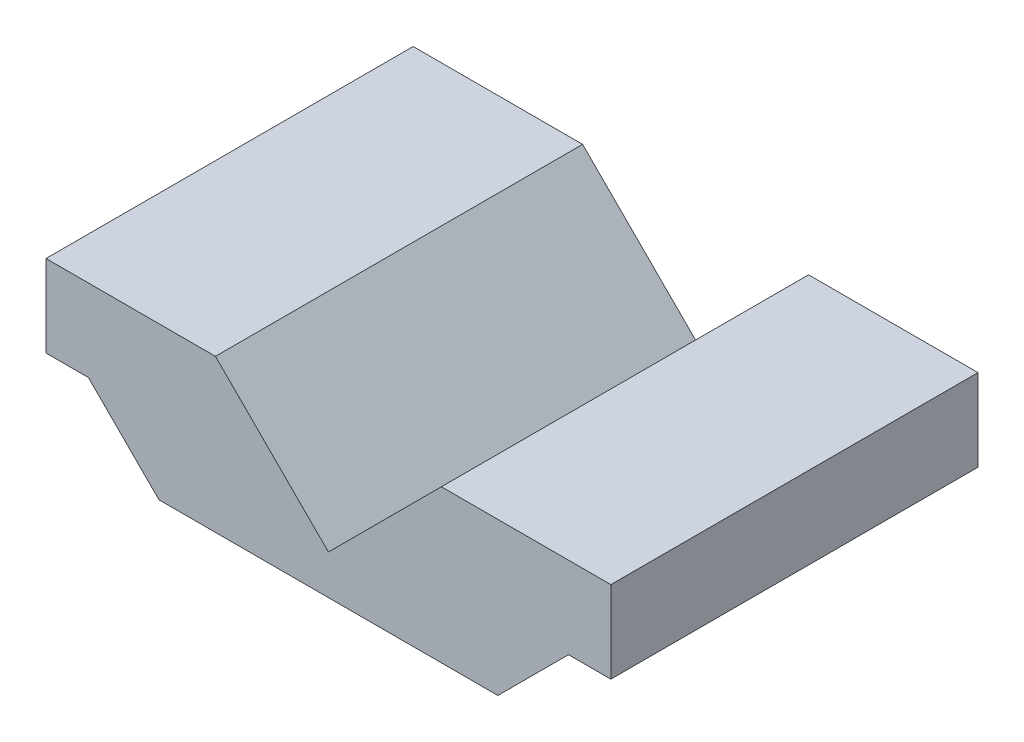
ISO-10303-21;
HEADER;
FILE_DESCRIPTION(('STEP AP214'),'2;1');
FILE_NAME('part.step','',(''),(''),'','','');
FILE_SCHEMA(('AUTOMOTIVE_DESIGN { 1 0 10303 214 1 1 1 1 }'));
ENDSEC;
DATA;
#1=APPLICATION_CONTEXT('core data for automotive mechanical design processes');
#2=APPLICATION_PROTOCOL_DEFINITION('international standard','automotive_design',2000,#1);
#3=PRODUCT_CONTEXT('',#1,'mechanical');
#4=PRODUCT('Part','Part','',(#3));
#5=PRODUCT_RELATED_PRODUCT_CATEGORY('part','',(#4));
#6=PRODUCT_DEFINITION_FORMATION('','',#4);
#7=PRODUCT_DEFINITION_CONTEXT('part definition',#1,'design');
#8=PRODUCT_DEFINITION('design','',#6,#7);
#9=PRODUCT_DEFINITION_SHAPE('','',#8);
#10=(LENGTH_UNIT() NAMED_UNIT(*) SI_UNIT(.MILLI.,.METRE.));
#11=(NAMED_UNIT(*) PLANE_ANGLE_UNIT() SI_UNIT($,.RADIAN.));
#12=(NAMED_UNIT(*) SI_UNIT($,.STERADIAN.) SOLID_ANGLE_UNIT());
#13=UNCERTAINTY_MEASURE_WITH_UNIT(LENGTH_MEASURE(1.E-05),#10,'distance_accuracy_value','');
#14=(GEOMETRIC_REPRESENTATION_CONTEXT(3) GLOBAL_UNCERTAINTY_ASSIGNED_CONTEXT((#13)) GLOBAL_UNIT_ASSIGNED_CONTEXT((#10,
#11,#12)) REPRESENTATION_CONTEXT('',''));
#15=CARTESIAN_POINT('',(0.,0.,0.));
#16=DIRECTION('',(0.,0.,1.));
#17=DIRECTION('',(1.,0.,0.));
#18=AXIS2_PLACEMENT_3D('',#15,#16,#17);
#19=CARTESIAN_POINT('',(30.,0.,32.5));
#20=DIRECTION('',(-0.707106781186549,0.707106781186546,0.));
#21=DIRECTION('',(-0.707106781186546,-0.707106781186549,0.));
#22=AXIS2_PLACEMENT_3D('',#19,#20,#21);
#23=PLANE('',#22);
#24=DIRECTION('',(0.707106781186546,0.707106781186549,0.));
#25=VECTOR('',#24,1.);
#26=CARTESIAN_POINT('',(30.,0.,-32.5));
#27=LINE('',#26,#25);
#28=CARTESIAN_POINT('',(30.,0.,-32.5));
#29=VERTEX_POINT('',#28);
#30=CARTESIAN_POINT('',(42.5,12.5,-32.5));
#31=VERTEX_POINT('',#30);
#32=EDGE_CURVE('E147',#29,#31,#27,.T.);
#33=ORIENTED_EDGE('',*,*,#32,.T.);
#34=DIRECTION('',(0.,0.,-1.));
#35=VECTOR('',#34,1.);
#36=CARTESIAN_POINT('',(42.5,12.5,32.5));
#37=LINE('',#36,#35);
#38=CARTESIAN_POINT('',(42.5,12.5,32.5));
#39=VERTEX_POINT('',#38);
#40=EDGE_CURVE('E11',#39,#31,#37,.T.);
#41=ORIENTED_EDGE('',*,*,#40,.F.);
#42=DIRECTION('',(0.707106781186546,0.707106781186549,0.));
#43=VECTOR('',#42,1.);
#44=CARTESIAN_POINT('',(30.,0.,32.5));
#45=LINE('',#44,#43);
#46=CARTESIAN_POINT('',(30.,0.,32.5));
#47=VERTEX_POINT('',#46);
#48=EDGE_CURVE('E167',#47,#39,#45,.T.);
#49=ORIENTED_EDGE('',*,*,#48,.F.);
#50=DIRECTION('',(0.,0.,-1.));
#51=VECTOR('',#50,1.);
#52=CARTESIAN_POINT('',(30.,0.,32.5));
#53=LINE('',#52,#51);
#54=EDGE_CURVE('E143',#47,#29,#53,.T.);
#55=ORIENTED_EDGE('',*,*,#54,.T.);
#56=EDGE_LOOP('',(#33,#41,#49,#55));
#57=FACE_BOUND('',#56,.T.);
#58=ADVANCED_FACE('F33',(#57),#23,.F.);
#59=CARTESIAN_POINT('',(42.5,12.5,32.5));
#60=DIRECTION('',(0.,1.,0.));
#61=DIRECTION('',(0.,0.,1.));
#62=AXIS2_PLACEMENT_3D('',#59,#60,#61);
#63=PLANE('',#62);
#64=DIRECTION('',(1.,0.,0.));
#65=VECTOR('',#64,1.);
#66=CARTESIAN_POINT('',(42.5,12.5,-32.5));
#67=LINE('',#66,#65);
#68=CARTESIAN_POINT('',(50.,12.5,-32.5));
#69=VERTEX_POINT('',#68);
#70=EDGE_CURVE('E150',#31,#69,#67,.T.);
#71=ORIENTED_EDGE('',*,*,#70,.T.);
#72=DIRECTION('',(0.,0.,-1.));
#73=VECTOR('',#72,1.);
#74=CARTESIAN_POINT('',(50.,12.5,32.5));
#75=LINE('',#74,#73);
#76=CARTESIAN_POINT('',(50.,12.5,32.5));
#77=VERTEX_POINT('',#76);
#78=EDGE_CURVE('E41',#77,#69,#75,.T.);
#79=ORIENTED_EDGE('',*,*,#78,.F.);
#80=DIRECTION('',(1.,0.,0.));
#81=VECTOR('',#80,1.);
#82=CARTESIAN_POINT('',(42.5,12.5,32.5));
#83=LINE('',#82,#81);
#84=EDGE_CURVE('E101',#39,#77,#83,.T.);
#85=ORIENTED_EDGE('',*,*,#84,.F.);
#86=ORIENTED_EDGE('',*,*,#40,.T.);
#87=EDGE_LOOP('',(#71,#79,#85,#86));
#88=FACE_BOUND('',#87,.T.);
#89=ADVANCED_FACE('F239',(#88),#63,.F.);
#90=CARTESIAN_POINT('',(50.,12.5,32.5));
#91=DIRECTION('',(-1.,0.,0.));
#92=DIRECTION('',(0.,-1.,0.));
#93=AXIS2_PLACEMENT_3D('',#90,#91,#92);
#94=PLANE('',#93);
#95=DIRECTION('',(0.,1.,0.));
#96=VECTOR('',#95,1.);
#97=CARTESIAN_POINT('',(50.,12.5,-32.5));
#98=LINE('',#97,#96);
#99=CARTESIAN_POINT('',(50.,27.,-32.5));
#100=VERTEX_POINT('',#99);
#101=EDGE_CURVE('E152',#69,#100,#98,.T.);
#102=ORIENTED_EDGE('',*,*,#101,.T.);
#103=DIRECTION('',(0.,0.,-1.));
#104=VECTOR('',#103,1.);
#105=CARTESIAN_POINT('',(50.,27.,32.5));
#106=LINE('',#105,#104);
#107=CARTESIAN_POINT('',(50.,27.,32.5));
#108=VERTEX_POINT('',#107);
#109=EDGE_CURVE('E183',#108,#100,#106,.T.);
#110=ORIENTED_EDGE('',*,*,#109,.F.);
#111=DIRECTION('',(0.,1.,0.));
#112=VECTOR('',#111,1.);
#113=CARTESIAN_POINT('',(50.,12.5,32.5));
#114=LINE('',#113,#112);
#115=EDGE_CURVE('E191',#77,#108,#114,.T.);
#116=ORIENTED_EDGE('',*,*,#115,.F.);
#117=ORIENTED_EDGE('',*,*,#78,.T.);
#118=EDGE_LOOP('',(#102,#110,#116,#117));
#119=FACE_BOUND('',#118,.T.);
#120=ADVANCED_FACE('F189',(#119),#94,.F.);
#121=CARTESIAN_POINT('',(50.,27.,32.5));
#122=DIRECTION('',(0.,-1.,0.));
#123=DIRECTION('',(1.,0.,0.));
#124=AXIS2_PLACEMENT_3D('',#121,#122,#123);
#125=PLANE('',#124);
#126=DIRECTION('',(-1.,0.,0.));
#127=VECTOR('',#126,1.);
#128=CARTESIAN_POINT('',(50.,27.,-32.5));
#129=LINE('',#128,#127);
#130=CARTESIAN_POINT('',(20.,27.,-32.5));
#131=VERTEX_POINT('',#130);
#132=EDGE_CURVE('E154',#100,#131,#129,.T.);
#133=ORIENTED_EDGE('',*,*,#132,.T.);
#134=DIRECTION('',(0.,0.,-1.));
#135=VECTOR('',#134,1.);
#136=CARTESIAN_POINT('',(20.,27.,32.5));
#137=LINE('',#136,#135);
#138=CARTESIAN_POINT('',(20.,27.,32.5));
#139=VERTEX_POINT('',#138);
#140=EDGE_CURVE('E180',#139,#131,#137,.T.);
#141=ORIENTED_EDGE('',*,*,#140,.F.);
#142=DIRECTION('',(-1.,0.,0.));
#143=VECTOR('',#142,1.);
#144=CARTESIAN_POINT('',(50.,27.,32.5));
#145=LINE('',#144,#143);
#146=EDGE_CURVE('E209',#108,#139,#145,.T.);
#147=ORIENTED_EDGE('',*,*,#146,.F.);
#148=ORIENTED_EDGE('',*,*,#109,.T.);
#149=EDGE_LOOP('',(#133,#141,#147,#148));
#150=FACE_BOUND('',#149,.T.);
#151=ADVANCED_FACE('F200',(#150),#125,.F.);
#152=CARTESIAN_POINT('',(20.,27.,32.5));
#153=DIRECTION('',(0.707106781186551,-0.707106781186543,0.));
#154=DIRECTION('',(0.707106781186544,0.707106781186551,0.));
#155=AXIS2_PLACEMENT_3D('',#152,#153,#154);
#156=PLANE('',#155);
#157=DIRECTION('',(-0.707106781186544,-0.707106781186551,0.));
#158=VECTOR('',#157,1.);
#159=CARTESIAN_POINT('',(20.,27.,-32.5));
#160=LINE('',#159,#158);
#161=CARTESIAN_POINT('',(0.,6.99999999999977,-32.5));
#162=VERTEX_POINT('',#161);
#163=EDGE_CURVE('E156',#131,#162,#160,.T.);
#164=ORIENTED_EDGE('',*,*,#163,.T.);
#165=DIRECTION('',(0.,0.,-1.));
#166=VECTOR('',#165,1.);
#167=CARTESIAN_POINT('',(0.,6.99999999999977,32.5));
#168=LINE('',#167,#166);
#169=CARTESIAN_POINT('',(0.,6.99999999999977,32.5));
#170=VERTEX_POINT('',#169);
#171=EDGE_CURVE('E177',#170,#162,#168,.T.);
#172=ORIENTED_EDGE('',*,*,#171,.F.);
#173=DIRECTION('',(-0.707106781186544,-0.707106781186551,0.));
#174=VECTOR('',#173,1.);
#175=CARTESIAN_POINT('',(20.,27.,32.5));
#176=LINE('',#175,#174);
#177=EDGE_CURVE('E206',#139,#170,#176,.T.);
#178=ORIENTED_EDGE('',*,*,#177,.F.);
#179=ORIENTED_EDGE('',*,*,#140,.T.);
#180=EDGE_LOOP('',(#164,#172,#178,#179));
#181=FACE_BOUND('',#180,.T.);
#182=ADVANCED_FACE('F204',(#181),#156,.F.);
#183=CARTESIAN_POINT('',(-20.,27.,32.5));
#184=DIRECTION('',(-0.707106781186551,-0.707106781186543,0.));
#185=DIRECTION('',(0.707106781186544,-0.707106781186551,0.));
#186=AXIS2_PLACEMENT_3D('',#183,#184,#185);
#187=PLANE('',#186);
#188=DIRECTION('',(-0.707106781186544,0.707106781186551,0.));
#189=VECTOR('',#188,1.);
#190=CARTESIAN_POINT('',(-20.,27.,-32.5));
#191=LINE('',#190,#189);
#192=CARTESIAN_POINT('',(-20.,27.,-32.5));
#193=VERTEX_POINT('',#192);
#194=EDGE_CURVE('E158',#162,#193,#191,.T.);
#195=ORIENTED_EDGE('',*,*,#194,.T.);
#196=DIRECTION('',(0.,0.,-1.));
#197=VECTOR('',#196,1.);
#198=CARTESIAN_POINT('',(-20.,27.,32.5));
#199=LINE('',#198,#197);
#200=CARTESIAN_POINT('',(-20.,27.,32.5));
#201=VERTEX_POINT('',#200);
#202=EDGE_CURVE('E174',#201,#193,#199,.T.);
#203=ORIENTED_EDGE('',*,*,#202,.F.);
#204=DIRECTION('',(-0.707106781186544,0.707106781186551,0.));
#205=VECTOR('',#204,1.);
#206=CARTESIAN_POINT('',(-20.,27.,32.5));
#207=LINE('',#206,#205);
#208=EDGE_CURVE('E208',#170,#201,#207,.T.);
#209=ORIENTED_EDGE('',*,*,#208,.F.);
#210=ORIENTED_EDGE('',*,*,#171,.T.);
#211=EDGE_LOOP('',(#195,#203,#209,#210));
#212=FACE_BOUND('',#211,.T.);
#213=ADVANCED_FACE('F252',(#212),#187,.F.);
#214=CARTESIAN_POINT('',(-50.,27.,32.5));
#215=DIRECTION('',(0.,-1.,0.));
#216=DIRECTION('',(1.,0.,0.));
#217=AXIS2_PLACEMENT_3D('',#214,#215,#216);
#218=PLANE('',#217);
#219=DIRECTION('',(-1.,0.,0.));
#220=VECTOR('',#219,1.);
#221=CARTESIAN_POINT('',(-50.,27.,-32.5));
#222=LINE('',#221,#220);
#223=CARTESIAN_POINT('',(-50.,27.,-32.5));
#224=VERTEX_POINT('',#223);
#225=EDGE_CURVE('E160',#193,#224,#222,.T.);
#226=ORIENTED_EDGE('',*,*,#225,.T.);
#227=DIRECTION('',(0.,0.,-1.));
#228=VECTOR('',#227,1.);
#229=CARTESIAN_POINT('',(-50.,27.,32.5));
#230=LINE('',#229,#228);
#231=CARTESIAN_POINT('',(-50.,27.,32.5));
#232=VERTEX_POINT('',#231);
#233=EDGE_CURVE('E171',#232,#224,#230,.T.);
#234=ORIENTED_EDGE('',*,*,#233,.F.);
#235=DIRECTION('',(-1.,0.,0.));
#236=VECTOR('',#235,1.);
#237=CARTESIAN_POINT('',(-50.,27.,32.5));
#238=LINE('',#237,#236);
#239=EDGE_CURVE('E211',#201,#232,#238,.T.);
#240=ORIENTED_EDGE('',*,*,#239,.F.);
#241=ORIENTED_EDGE('',*,*,#202,.T.);
#242=EDGE_LOOP('',(#226,#234,#240,#241));
#243=FACE_BOUND('',#242,.T.);
#244=ADVANCED_FACE('F220',(#243),#218,.F.);
#245=CARTESIAN_POINT('',(-50.,12.5,32.5));
#246=DIRECTION('',(1.,0.,0.));
#247=DIRECTION('',(0.,1.,0.));
#248=AXIS2_PLACEMENT_3D('',#245,#246,#247);
#249=PLANE('',#248);
#250=DIRECTION('',(0.,-1.,0.));
#251=VECTOR('',#250,1.);
#252=CARTESIAN_POINT('',(-50.,12.5,-32.5));
#253=LINE('',#252,#251);
#254=CARTESIAN_POINT('',(-50.,12.5,-32.5));
#255=VERTEX_POINT('',#254);
#256=EDGE_CURVE('E162',#224,#255,#253,.T.);
#257=ORIENTED_EDGE('',*,*,#256,.T.);
#258=DIRECTION('',(0.,0.,-1.));
#259=VECTOR('',#258,1.);
#260=CARTESIAN_POINT('',(-50.,12.5,32.5));
#261=LINE('',#260,#259);
#262=CARTESIAN_POINT('',(-50.,12.5,32.5));
#263=VERTEX_POINT('',#262);
#264=EDGE_CURVE('E138',#263,#255,#261,.T.);
#265=ORIENTED_EDGE('',*,*,#264,.F.);
#266=DIRECTION('',(0.,-1.,0.));
#267=VECTOR('',#266,1.);
#268=CARTESIAN_POINT('',(-50.,12.5,32.5));
#269=LINE('',#268,#267);
#270=EDGE_CURVE('E129',#232,#263,#269,.T.);
#271=ORIENTED_EDGE('',*,*,#270,.F.);
#272=ORIENTED_EDGE('',*,*,#233,.T.);
#273=EDGE_LOOP('',(#257,#265,#271,#272));
#274=FACE_BOUND('',#273,.T.);
#275=ADVANCED_FACE('F224',(#274),#249,.F.);
#276=CARTESIAN_POINT('',(-42.5,12.5,32.5));
#277=DIRECTION('',(0.,1.,0.));
#278=DIRECTION('',(0.,0.,1.));
#279=AXIS2_PLACEMENT_3D('',#276,#277,#278);
#280=PLANE('',#279);
#281=DIRECTION('',(1.,0.,0.));
#282=VECTOR('',#281,1.);
#283=CARTESIAN_POINT('',(-42.5,12.5,-32.5));
#284=LINE('',#283,#282);
#285=CARTESIAN_POINT('',(-42.5,12.5,-32.5));
#286=VERTEX_POINT('',#285);
#287=EDGE_CURVE('E137',#255,#286,#284,.T.);
#288=ORIENTED_EDGE('',*,*,#287,.T.);
#289=DIRECTION('',(0.,0.,-1.));
#290=VECTOR('',#289,1.);
#291=CARTESIAN_POINT('',(-42.5,12.5,32.5));
#292=LINE('',#291,#290);
#293=CARTESIAN_POINT('',(-42.5,12.5,32.5));
#294=VERTEX_POINT('',#293);
#295=EDGE_CURVE('E134',#294,#286,#292,.T.);
#296=ORIENTED_EDGE('',*,*,#295,.F.);
#297=DIRECTION('',(1.,0.,0.));
#298=VECTOR('',#297,1.);
#299=CARTESIAN_POINT('',(-42.5,12.5,32.5));
#300=LINE('',#299,#298);
#301=EDGE_CURVE('E123',#263,#294,#300,.T.);
#302=ORIENTED_EDGE('',*,*,#301,.F.);
#303=ORIENTED_EDGE('',*,*,#264,.T.);
#304=EDGE_LOOP('',(#288,#296,#302,#303));
#305=FACE_BOUND('',#304,.T.);
#306=ADVANCED_FACE('F135',(#305),#280,.F.);
#307=CARTESIAN_POINT('',(-30.,0.,32.5));
#308=DIRECTION('',(0.707106781186549,0.707106781186546,0.));
#309=DIRECTION('',(-0.707106781186546,0.707106781186549,0.));
#310=AXIS2_PLACEMENT_3D('',#307,#308,#309);
#311=PLANE('',#310);
#312=DIRECTION('',(0.707106781186546,-0.707106781186549,0.));
#313=VECTOR('',#312,1.);
#314=CARTESIAN_POINT('',(-30.,0.,-32.5));
#315=LINE('',#314,#313);
#316=CARTESIAN_POINT('',(-30.,0.,-32.5));
#317=VERTEX_POINT('',#316);
#318=EDGE_CURVE('E87',#286,#317,#315,.T.);
#319=ORIENTED_EDGE('',*,*,#318,.T.);
#320=DIRECTION('',(0.,0.,-1.));
#321=VECTOR('',#320,1.);
#322=CARTESIAN_POINT('',(-30.,0.,32.5));
#323=LINE('',#322,#321);
#324=CARTESIAN_POINT('',(-30.,0.,32.5));
#325=VERTEX_POINT('',#324);
#326=EDGE_CURVE('E139',#325,#317,#323,.T.);
#327=ORIENTED_EDGE('',*,*,#326,.F.);
#328=DIRECTION('',(0.707106781186546,-0.707106781186549,0.));
#329=VECTOR('',#328,1.);
#330=CARTESIAN_POINT('',(-30.,0.,32.5));
#331=LINE('',#330,#329);
#332=EDGE_CURVE('E127',#294,#325,#331,.T.);
#333=ORIENTED_EDGE('',*,*,#332,.F.);
#334=ORIENTED_EDGE('',*,*,#295,.T.);
#335=EDGE_LOOP('',(#319,#327,#333,#334));
#336=FACE_BOUND('',#335,.T.);
#337=ADVANCED_FACE('F141',(#336),#311,.F.);
#338=CARTESIAN_POINT('',(-30.,0.,32.5));
#339=DIRECTION('',(0.,1.,0.));
#340=DIRECTION('',(0.,0.,1.));
#341=AXIS2_PLACEMENT_3D('',#338,#339,#340);
#342=PLANE('',#341);
#343=DIRECTION('',(1.,0.,0.));
#344=VECTOR('',#343,1.);
#345=CARTESIAN_POINT('',(-30.,0.,-32.5));
#346=LINE('',#345,#344);
#347=EDGE_CURVE('E93',#317,#29,#346,.T.);
#348=ORIENTED_EDGE('',*,*,#347,.T.);
#349=ORIENTED_EDGE('',*,*,#54,.F.);
#350=DIRECTION('',(1.,0.,0.));
#351=VECTOR('',#350,1.);
#352=CARTESIAN_POINT('',(-30.,0.,32.5));
#353=LINE('',#352,#351);
#354=EDGE_CURVE('E49',#325,#47,#353,.T.);
#355=ORIENTED_EDGE('',*,*,#354,.F.);
#356=ORIENTED_EDGE('',*,*,#326,.T.);
#357=EDGE_LOOP('',(#348,#349,#355,#356));
#358=FACE_BOUND('',#357,.T.);
#359=ADVANCED_FACE('F228',(#358),#342,.F.);
#360=CARTESIAN_POINT('',(0.,0.,32.5));
#361=DIRECTION('',(0.,0.,-1.));
#362=DIRECTION('',(-1.,0.,0.));
#363=AXIS2_PLACEMENT_3D('',#360,#361,#362);
#364=PLANE('',#363);
#365=ORIENTED_EDGE('',*,*,#48,.T.);
#366=ORIENTED_EDGE('',*,*,#84,.T.);
#367=ORIENTED_EDGE('',*,*,#115,.T.);
#368=ORIENTED_EDGE('',*,*,#146,.T.);
#369=ORIENTED_EDGE('',*,*,#177,.T.);
#370=ORIENTED_EDGE('',*,*,#208,.T.);
#371=ORIENTED_EDGE('',*,*,#239,.T.);
#372=ORIENTED_EDGE('',*,*,#270,.T.);
#373=ORIENTED_EDGE('',*,*,#301,.T.);
#374=ORIENTED_EDGE('',*,*,#332,.T.);
#375=ORIENTED_EDGE('',*,*,#354,.T.);
#376=EDGE_LOOP('',(#365,#366,#367,#368,#369,#370,#371,#372,#373,#374,#375));
#377=FACE_BOUND('',#376,.T.);
#378=ADVANCED_FACE('F125',(#377),#364,.F.);
#379=CARTESIAN_POINT('',(0.,0.,-32.5));
#380=DIRECTION('',(0.,0.,-1.));
#381=DIRECTION('',(-1.,0.,0.));
#382=AXIS2_PLACEMENT_3D('',#379,#380,#381);
#383=PLANE('',#382);
#384=ORIENTED_EDGE('',*,*,#32,.F.);
#385=ORIENTED_EDGE('',*,*,#347,.F.);
#386=ORIENTED_EDGE('',*,*,#318,.F.);
#387=ORIENTED_EDGE('',*,*,#287,.F.);
#388=ORIENTED_EDGE('',*,*,#256,.F.);
#389=ORIENTED_EDGE('',*,*,#225,.F.);
#390=ORIENTED_EDGE('',*,*,#194,.F.);
#391=ORIENTED_EDGE('',*,*,#163,.F.);
#392=ORIENTED_EDGE('',*,*,#132,.F.);
#393=ORIENTED_EDGE('',*,*,#101,.F.);
#394=ORIENTED_EDGE('',*,*,#70,.F.);
#395=EDGE_LOOP('',(#384,#385,#386,#387,#388,#389,#390,#391,#392,#393,#394));
#396=FACE_BOUND('',#395,.T.);
#397=ADVANCED_FACE('F195',(#396),#383,.T.);
#398=CLOSED_SHELL('',(#58,#89,#120,#151,#182,#213,#244,#275,#306,#337,#359,#378,#397));
#399=MANIFOLD_SOLID_BREP('B2',#398);
#400=ADVANCED_BREP_SHAPE_REPRESENTATION('',(#18,#399),#14);
#401=SHAPE_DEFINITION_REPRESENTATION(#9,#400);
ENDSEC;
END-ISO-10303-21;
